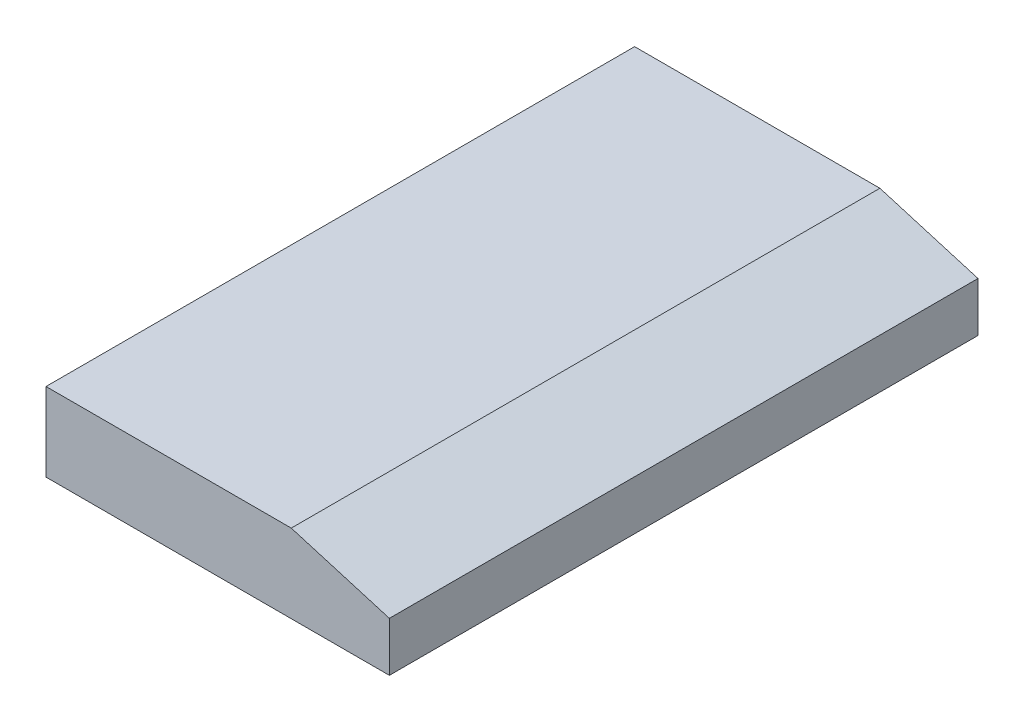
ISO-10303-21;
HEADER;
FILE_DESCRIPTION(('STEP AP214'),'2;1');
FILE_NAME('part.step','',(''),(''),'','','');
FILE_SCHEMA(('AUTOMOTIVE_DESIGN { 1 0 10303 214 1 1 1 1 }'));
ENDSEC;
DATA;
#1=APPLICATION_CONTEXT('core data for automotive mechanical design processes');
#2=APPLICATION_PROTOCOL_DEFINITION('international standard','automotive_design',2000,#1);
#3=PRODUCT_CONTEXT('',#1,'mechanical');
#4=PRODUCT('Part','Part','',(#3));
#5=PRODUCT_RELATED_PRODUCT_CATEGORY('part','',(#4));
#6=PRODUCT_DEFINITION_FORMATION('','',#4);
#7=PRODUCT_DEFINITION_CONTEXT('part definition',#1,'design');
#8=PRODUCT_DEFINITION('design','',#6,#7);
#9=PRODUCT_DEFINITION_SHAPE('','',#8);
#10=(LENGTH_UNIT() NAMED_UNIT(*) SI_UNIT(.MILLI.,.METRE.));
#11=(NAMED_UNIT(*) PLANE_ANGLE_UNIT() SI_UNIT($,.RADIAN.));
#12=(NAMED_UNIT(*) SI_UNIT($,.STERADIAN.) SOLID_ANGLE_UNIT());
#13=UNCERTAINTY_MEASURE_WITH_UNIT(LENGTH_MEASURE(1.E-05),#10,'distance_accuracy_value','');
#14=(GEOMETRIC_REPRESENTATION_CONTEXT(3) GLOBAL_UNCERTAINTY_ASSIGNED_CONTEXT((#13)) GLOBAL_UNIT_ASSIGNED_CONTEXT((#10,
#11,#12)) REPRESENTATION_CONTEXT('',''));
#15=CARTESIAN_POINT('',(0.,0.,0.));
#16=DIRECTION('',(0.,0.,1.));
#17=DIRECTION('',(1.,0.,0.));
#18=AXIS2_PLACEMENT_3D('',#15,#16,#17);
#19=CARTESIAN_POINT('',(-175.,-40.,600.));
#20=DIRECTION('',(-1.,0.,0.));
#21=DIRECTION('',(0.,0.,1.));
#22=AXIS2_PLACEMENT_3D('',#19,#20,#21);
#23=PLANE('',#22);
#24=DIRECTION('',(0.,1.,0.));
#25=VECTOR('',#24,1.);
#26=CARTESIAN_POINT('',(-175.,-40.,0.));
#27=LINE('',#26,#25);
#28=CARTESIAN_POINT('',(-175.,-40.,0.));
#29=VERTEX_POINT('',#28);
#30=CARTESIAN_POINT('',(-175.,40.,0.));
#31=VERTEX_POINT('',#30);
#32=EDGE_CURVE('E117',#29,#31,#27,.T.);
#33=ORIENTED_EDGE('',*,*,#32,.F.);
#34=DIRECTION('',(0.,0.,-1.));
#35=VECTOR('',#34,1.);
#36=CARTESIAN_POINT('',(-175.,-40.,600.));
#37=LINE('',#36,#35);
#38=CARTESIAN_POINT('',(-175.,-40.,600.));
#39=VERTEX_POINT('',#38);
#40=EDGE_CURVE('E11',#39,#29,#37,.T.);
#41=ORIENTED_EDGE('',*,*,#40,.F.);
#42=DIRECTION('',(0.,1.,0.));
#43=VECTOR('',#42,1.);
#44=CARTESIAN_POINT('',(-175.,-40.,600.));
#45=LINE('',#44,#43);
#46=CARTESIAN_POINT('',(-175.,40.,600.));
#47=VERTEX_POINT('',#46);
#48=EDGE_CURVE('E112',#39,#47,#45,.T.);
#49=ORIENTED_EDGE('',*,*,#48,.T.);
#50=DIRECTION('',(0.,0.,-1.));
#51=VECTOR('',#50,1.);
#52=CARTESIAN_POINT('',(-175.,40.,600.));
#53=LINE('',#52,#51);
#54=EDGE_CURVE('E41',#47,#31,#53,.T.);
#55=ORIENTED_EDGE('',*,*,#54,.T.);
#56=EDGE_LOOP('',(#33,#41,#49,#55));
#57=FACE_BOUND('',#56,.T.);
#58=ADVANCED_FACE('F38',(#57),#23,.T.);
#59=CARTESIAN_POINT('',(-175.,-40.,600.));
#60=DIRECTION('',(0.,1.,0.));
#61=DIRECTION('',(0.,0.,1.));
#62=AXIS2_PLACEMENT_3D('',#59,#60,#61);
#63=PLANE('',#62);
#64=DIRECTION('',(1.,0.,0.));
#65=VECTOR('',#64,1.);
#66=CARTESIAN_POINT('',(-175.,-40.,0.));
#67=LINE('',#66,#65);
#68=CARTESIAN_POINT('',(175.,-40.,0.));
#69=VERTEX_POINT('',#68);
#70=EDGE_CURVE('E74',#29,#69,#67,.T.);
#71=ORIENTED_EDGE('',*,*,#70,.T.);
#72=DIRECTION('',(0.,0.,-1.));
#73=VECTOR('',#72,1.);
#74=CARTESIAN_POINT('',(175.,-40.,600.));
#75=LINE('',#74,#73);
#76=CARTESIAN_POINT('',(175.,-40.,600.));
#77=VERTEX_POINT('',#76);
#78=EDGE_CURVE('E47',#77,#69,#75,.T.);
#79=ORIENTED_EDGE('',*,*,#78,.F.);
#80=DIRECTION('',(1.,0.,0.));
#81=VECTOR('',#80,1.);
#82=CARTESIAN_POINT('',(-175.,-40.,600.));
#83=LINE('',#82,#81);
#84=EDGE_CURVE('E96',#39,#77,#83,.T.);
#85=ORIENTED_EDGE('',*,*,#84,.F.);
#86=ORIENTED_EDGE('',*,*,#40,.T.);
#87=EDGE_LOOP('',(#71,#79,#85,#86));
#88=FACE_BOUND('',#87,.T.);
#89=ADVANCED_FACE('F138',(#88),#63,.F.);
#90=CARTESIAN_POINT('',(175.,-40.,600.));
#91=DIRECTION('',(-1.,0.,0.));
#92=DIRECTION('',(0.,0.,1.));
#93=AXIS2_PLACEMENT_3D('',#90,#91,#92);
#94=PLANE('',#93);
#95=DIRECTION('',(0.,1.,0.));
#96=VECTOR('',#95,1.);
#97=CARTESIAN_POINT('',(175.,-40.,0.));
#98=LINE('',#97,#96);
#99=CARTESIAN_POINT('',(175.,10.3484165477889,0.));
#100=VERTEX_POINT('',#99);
#101=EDGE_CURVE('E103',#69,#100,#98,.T.);
#102=ORIENTED_EDGE('',*,*,#101,.T.);
#103=DIRECTION('',(0.,0.,-1.));
#104=VECTOR('',#103,1.);
#105=CARTESIAN_POINT('',(175.,10.3484165477889,600.));
#106=LINE('',#105,#104);
#107=CARTESIAN_POINT('',(175.,10.3484165477889,600.));
#108=VERTEX_POINT('',#107);
#109=EDGE_CURVE('E100',#108,#100,#106,.T.);
#110=ORIENTED_EDGE('',*,*,#109,.F.);
#111=DIRECTION('',(0.,1.,0.));
#112=VECTOR('',#111,1.);
#113=CARTESIAN_POINT('',(175.,-40.,600.));
#114=LINE('',#113,#112);
#115=EDGE_CURVE('E90',#77,#108,#114,.T.);
#116=ORIENTED_EDGE('',*,*,#115,.F.);
#117=ORIENTED_EDGE('',*,*,#78,.T.);
#118=EDGE_LOOP('',(#102,#110,#116,#117));
#119=FACE_BOUND('',#118,.T.);
#120=ADVANCED_FACE('F101',(#119),#94,.F.);
#121=CARTESIAN_POINT('',(75.,40.,600.));
#122=DIRECTION('',(0.284281817095877,0.958740761868748,0.));
#123=DIRECTION('',(-0.958740761868748,0.284281817095877,0.));
#124=AXIS2_PLACEMENT_3D('',#121,#122,#123);
#125=PLANE('',#124);
#126=DIRECTION('',(0.958740761868748,-0.284281817095877,0.));
#127=VECTOR('',#126,1.);
#128=CARTESIAN_POINT('',(75.,40.,0.));
#129=LINE('',#128,#127);
#130=CARTESIAN_POINT('',(75.,40.,0.));
#131=VERTEX_POINT('',#130);
#132=EDGE_CURVE('E123',#131,#100,#129,.T.);
#133=ORIENTED_EDGE('',*,*,#132,.F.);
#134=DIRECTION('',(0.,0.,-1.));
#135=VECTOR('',#134,1.);
#136=CARTESIAN_POINT('',(75.,40.,600.));
#137=LINE('',#136,#135);
#138=CARTESIAN_POINT('',(75.,40.,600.));
#139=VERTEX_POINT('',#138);
#140=EDGE_CURVE('E107',#139,#131,#137,.T.);
#141=ORIENTED_EDGE('',*,*,#140,.F.);
#142=DIRECTION('',(0.958740761868748,-0.284281817095877,0.));
#143=VECTOR('',#142,1.);
#144=CARTESIAN_POINT('',(75.,40.,600.));
#145=LINE('',#144,#143);
#146=EDGE_CURVE('E95',#139,#108,#145,.T.);
#147=ORIENTED_EDGE('',*,*,#146,.T.);
#148=ORIENTED_EDGE('',*,*,#109,.T.);
#149=EDGE_LOOP('',(#133,#141,#147,#148));
#150=FACE_BOUND('',#149,.T.);
#151=ADVANCED_FACE('F109',(#150),#125,.T.);
#152=CARTESIAN_POINT('',(-175.,40.,600.));
#153=DIRECTION('',(0.,1.,0.));
#154=DIRECTION('',(0.,0.,1.));
#155=AXIS2_PLACEMENT_3D('',#152,#153,#154);
#156=PLANE('',#155);
#157=DIRECTION('',(1.,0.,0.));
#158=VECTOR('',#157,1.);
#159=CARTESIAN_POINT('',(-175.,40.,0.));
#160=LINE('',#159,#158);
#161=EDGE_CURVE('E120',#31,#131,#160,.T.);
#162=ORIENTED_EDGE('',*,*,#161,.F.);
#163=ORIENTED_EDGE('',*,*,#54,.F.);
#164=DIRECTION('',(1.,0.,0.));
#165=VECTOR('',#164,1.);
#166=CARTESIAN_POINT('',(-175.,40.,600.));
#167=LINE('',#166,#165);
#168=EDGE_CURVE('E110',#47,#139,#167,.T.);
#169=ORIENTED_EDGE('',*,*,#168,.T.);
#170=ORIENTED_EDGE('',*,*,#140,.T.);
#171=EDGE_LOOP('',(#162,#163,#169,#170));
#172=FACE_BOUND('',#171,.T.);
#173=ADVANCED_FACE('F127',(#172),#156,.T.);
#174=CARTESIAN_POINT('',(0.,0.,600.));
#175=DIRECTION('',(0.,0.,-1.));
#176=DIRECTION('',(-1.,0.,0.));
#177=AXIS2_PLACEMENT_3D('',#174,#175,#176);
#178=PLANE('',#177);
#179=ORIENTED_EDGE('',*,*,#48,.F.);
#180=ORIENTED_EDGE('',*,*,#84,.T.);
#181=ORIENTED_EDGE('',*,*,#115,.T.);
#182=ORIENTED_EDGE('',*,*,#146,.F.);
#183=ORIENTED_EDGE('',*,*,#168,.F.);
#184=EDGE_LOOP('',(#179,#180,#181,#182,#183));
#185=FACE_BOUND('',#184,.T.);
#186=ADVANCED_FACE('F93',(#185),#178,.F.);
#187=CARTESIAN_POINT('',(0.,0.,0.));
#188=DIRECTION('',(0.,0.,-1.));
#189=DIRECTION('',(-1.,0.,0.));
#190=AXIS2_PLACEMENT_3D('',#187,#188,#189);
#191=PLANE('',#190);
#192=ORIENTED_EDGE('',*,*,#32,.T.);
#193=ORIENTED_EDGE('',*,*,#161,.T.);
#194=ORIENTED_EDGE('',*,*,#132,.T.);
#195=ORIENTED_EDGE('',*,*,#101,.F.);
#196=ORIENTED_EDGE('',*,*,#70,.F.);
#197=EDGE_LOOP('',(#192,#193,#194,#195,#196));
#198=FACE_BOUND('',#197,.T.);
#199=ADVANCED_FACE('F129',(#198),#191,.T.);
#200=CLOSED_SHELL('',(#58,#89,#120,#151,#173,#186,#199));
#201=MANIFOLD_SOLID_BREP('B2',#200);
#202=ADVANCED_BREP_SHAPE_REPRESENTATION('',(#18,#201),#14);
#203=SHAPE_DEFINITION_REPRESENTATION(#9,#202);
ENDSEC;
END-ISO-10303-21;
